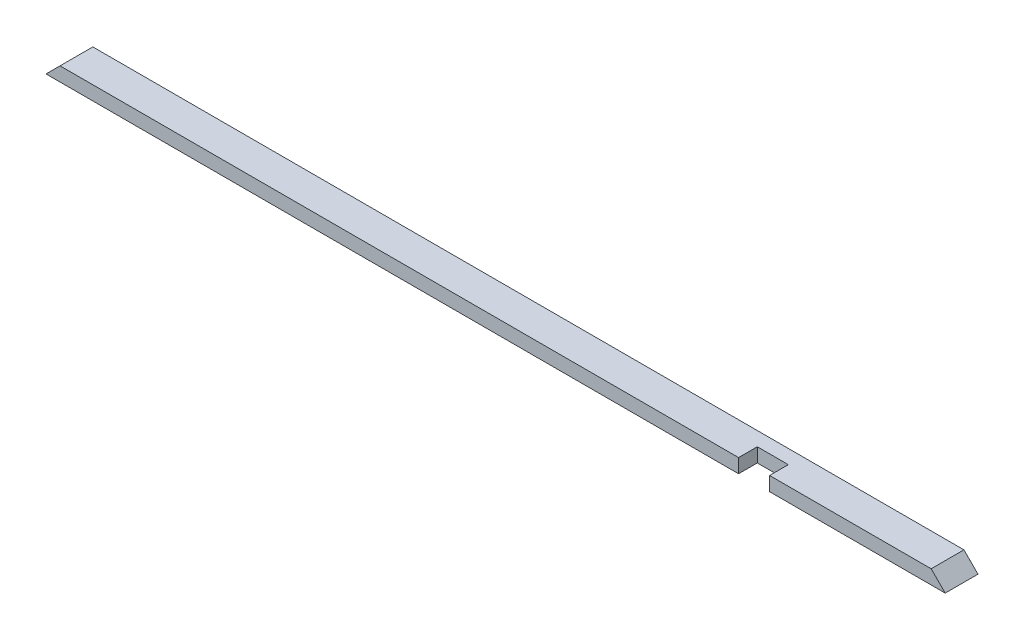
ISO-10303-21;
HEADER;
FILE_DESCRIPTION(('STEP AP214'),'2;1');
FILE_NAME('part.step','',(''),(''),'','','');
FILE_SCHEMA(('AUTOMOTIVE_DESIGN { 1 0 10303 214 1 1 1 1 }'));
ENDSEC;
DATA;
#1=APPLICATION_CONTEXT('core data for automotive mechanical design processes');
#2=APPLICATION_PROTOCOL_DEFINITION('international standard','automotive_design',2000,#1);
#3=PRODUCT_CONTEXT('',#1,'mechanical');
#4=PRODUCT('Part','Part','',(#3));
#5=PRODUCT_RELATED_PRODUCT_CATEGORY('part','',(#4));
#6=PRODUCT_DEFINITION_FORMATION('','',#4);
#7=PRODUCT_DEFINITION_CONTEXT('part definition',#1,'design');
#8=PRODUCT_DEFINITION('design','',#6,#7);
#9=PRODUCT_DEFINITION_SHAPE('','',#8);
#10=(LENGTH_UNIT() NAMED_UNIT(*) SI_UNIT(.MILLI.,.METRE.));
#11=(NAMED_UNIT(*) PLANE_ANGLE_UNIT() SI_UNIT($,.RADIAN.));
#12=(NAMED_UNIT(*) SI_UNIT($,.STERADIAN.) SOLID_ANGLE_UNIT());
#13=UNCERTAINTY_MEASURE_WITH_UNIT(LENGTH_MEASURE(1.E-05),#10,'distance_accuracy_value','');
#14=(GEOMETRIC_REPRESENTATION_CONTEXT(3) GLOBAL_UNCERTAINTY_ASSIGNED_CONTEXT((#13)) GLOBAL_UNIT_ASSIGNED_CONTEXT((#10,
#11,#12)) REPRESENTATION_CONTEXT('',''));
#15=CARTESIAN_POINT('',(0.,0.,0.));
#16=DIRECTION('',(0.,0.,1.));
#17=DIRECTION('',(1.,0.,0.));
#18=AXIS2_PLACEMENT_3D('',#15,#16,#17);
#19=CARTESIAN_POINT('',(0.,38.1,0.));
#20=DIRECTION('',(0.,0.,-1.));
#21=DIRECTION('',(-1.,0.,0.));
#22=AXIS2_PLACEMENT_3D('',#19,#20,#21);
#23=PLANE('',#22);
#24=DIRECTION('',(1.,0.,0.));
#25=VECTOR('',#24,1.);
#26=CARTESIAN_POINT('',(0.,38.1,0.));
#27=LINE('',#26,#25);
#28=CARTESIAN_POINT('',(1962.15,38.1,0.));
#29=VERTEX_POINT('',#28);
#30=CARTESIAN_POINT('',(2400.3,38.1,0.));
#31=VERTEX_POINT('',#30);
#32=EDGE_CURVE('E158',#29,#31,#27,.T.);
#33=ORIENTED_EDGE('',*,*,#32,.F.);
#34=DIRECTION('',(0.,1.,0.));
#35=VECTOR('',#34,1.);
#36=CARTESIAN_POINT('',(1962.15,0.,0.));
#37=LINE('',#36,#35);
#38=CARTESIAN_POINT('',(1962.15,0.,0.));
#39=VERTEX_POINT('',#38);
#40=EDGE_CURVE('E135',#39,#29,#37,.T.);
#41=ORIENTED_EDGE('',*,*,#40,.F.);
#42=DIRECTION('',(1.,0.,0.));
#43=VECTOR('',#42,1.);
#44=CARTESIAN_POINT('',(0.,0.,0.));
#45=LINE('',#44,#43);
#46=CARTESIAN_POINT('',(2438.4,0.,0.));
#47=VERTEX_POINT('',#46);
#48=EDGE_CURVE('E126',#39,#47,#45,.T.);
#49=ORIENTED_EDGE('',*,*,#48,.T.);
#50=DIRECTION('',(0.707106781186548,-0.707106781186547,0.));
#51=VECTOR('',#50,1.);
#52=CARTESIAN_POINT('',(2400.3,38.1,0.));
#53=LINE('',#52,#51);
#54=EDGE_CURVE('E146',#31,#47,#53,.T.);
#55=ORIENTED_EDGE('',*,*,#54,.F.);
#56=EDGE_LOOP('',(#33,#41,#49,#55));
#57=FACE_BOUND('',#56,.T.);
#58=ADVANCED_FACE('F39',(#57),#23,.F.);
#59=CARTESIAN_POINT('',(0.,0.,0.));
#60=VERTEX_POINT('',#59);
#61=CARTESIAN_POINT('',(1878.0125,0.,0.));
#62=VERTEX_POINT('',#61);
#63=EDGE_CURVE('E161',#60,#62,#45,.T.);
#64=ORIENTED_EDGE('',*,*,#63,.T.);
#65=DIRECTION('',(0.,1.,0.));
#66=VECTOR('',#65,1.);
#67=CARTESIAN_POINT('',(1878.0125,0.,0.));
#68=LINE('',#67,#66);
#69=CARTESIAN_POINT('',(1878.0125,38.1,0.));
#70=VERTEX_POINT('',#69);
#71=EDGE_CURVE('E138',#62,#70,#68,.T.);
#72=ORIENTED_EDGE('',*,*,#71,.T.);
#73=CARTESIAN_POINT('',(38.1,38.1,0.));
#74=VERTEX_POINT('',#73);
#75=EDGE_CURVE('E48',#74,#70,#27,.T.);
#76=ORIENTED_EDGE('',*,*,#75,.F.);
#77=DIRECTION('',(0.707106781186547,0.707106781186547,0.));
#78=VECTOR('',#77,1.);
#79=CARTESIAN_POINT('',(0.,0.,0.));
#80=LINE('',#79,#78);
#81=EDGE_CURVE('E144',#60,#74,#80,.T.);
#82=ORIENTED_EDGE('',*,*,#81,.F.);
#83=EDGE_LOOP('',(#64,#72,#76,#82));
#84=FACE_BOUND('',#83,.T.);
#85=ADVANCED_FACE('F41',(#84),#23,.F.);
#86=CARTESIAN_POINT('',(0.,38.1,-88.9));
#87=DIRECTION('',(0.,0.,1.));
#88=DIRECTION('',(1.,0.,0.));
#89=AXIS2_PLACEMENT_3D('',#86,#87,#88);
#90=PLANE('',#89);
#91=DIRECTION('',(-1.,0.,0.));
#92=VECTOR('',#91,1.);
#93=CARTESIAN_POINT('',(0.,0.,-88.9));
#94=LINE('',#93,#92);
#95=CARTESIAN_POINT('',(2438.4,0.,-88.9));
#96=VERTEX_POINT('',#95);
#97=CARTESIAN_POINT('',(0.,0.,-88.9));
#98=VERTEX_POINT('',#97);
#99=EDGE_CURVE('E43',#96,#98,#94,.T.);
#100=ORIENTED_EDGE('',*,*,#99,.T.);
#101=DIRECTION('',(0.707106781186547,0.707106781186547,0.));
#102=VECTOR('',#101,1.);
#103=CARTESIAN_POINT('',(0.,0.,-88.9));
#104=LINE('',#103,#102);
#105=CARTESIAN_POINT('',(38.1,38.1,-88.9));
#106=VERTEX_POINT('',#105);
#107=EDGE_CURVE('E64',#98,#106,#104,.T.);
#108=ORIENTED_EDGE('',*,*,#107,.T.);
#109=DIRECTION('',(-1.,0.,0.));
#110=VECTOR('',#109,1.);
#111=CARTESIAN_POINT('',(0.,38.1,-88.9));
#112=LINE('',#111,#110);
#113=CARTESIAN_POINT('',(2400.3,38.1,-88.9));
#114=VERTEX_POINT('',#113);
#115=EDGE_CURVE('E11',#114,#106,#112,.T.);
#116=ORIENTED_EDGE('',*,*,#115,.F.);
#117=DIRECTION('',(0.707106781186548,-0.707106781186547,0.));
#118=VECTOR('',#117,1.);
#119=CARTESIAN_POINT('',(2400.3,38.1,-88.9));
#120=LINE('',#119,#118);
#121=EDGE_CURVE('E152',#114,#96,#120,.T.);
#122=ORIENTED_EDGE('',*,*,#121,.T.);
#123=EDGE_LOOP('',(#100,#108,#116,#122));
#124=FACE_BOUND('',#123,.T.);
#125=ADVANCED_FACE('F181',(#124),#90,.F.);
#126=CARTESIAN_POINT('',(0.,38.1,0.));
#127=DIRECTION('',(0.,-1.,0.));
#128=DIRECTION('',(0.,0.,-1.));
#129=AXIS2_PLACEMENT_3D('',#126,#127,#128);
#130=PLANE('',#129);
#131=DIRECTION('',(-1.,0.,0.));
#132=VECTOR('',#131,1.);
#133=CARTESIAN_POINT('',(1962.15,38.1,-50.8));
#134=LINE('',#133,#132);
#135=CARTESIAN_POINT('',(1962.15,38.1,-50.8));
#136=VERTEX_POINT('',#135);
#137=CARTESIAN_POINT('',(1878.0125,38.1,-50.8));
#138=VERTEX_POINT('',#137);
#139=EDGE_CURVE('E129',#136,#138,#134,.T.);
#140=ORIENTED_EDGE('',*,*,#139,.F.);
#141=DIRECTION('',(0.,0.,-1.));
#142=VECTOR('',#141,1.);
#143=CARTESIAN_POINT('',(1962.15,38.1,0.));
#144=LINE('',#143,#142);
#145=EDGE_CURVE('E112',#29,#136,#144,.T.);
#146=ORIENTED_EDGE('',*,*,#145,.F.);
#147=ORIENTED_EDGE('',*,*,#32,.T.);
#148=DIRECTION('',(0.,0.,1.));
#149=VECTOR('',#148,1.);
#150=CARTESIAN_POINT('',(2400.3,38.1,-88.9));
#151=LINE('',#150,#149);
#152=EDGE_CURVE('E137',#114,#31,#151,.T.);
#153=ORIENTED_EDGE('',*,*,#152,.F.);
#154=ORIENTED_EDGE('',*,*,#115,.T.);
#155=DIRECTION('',(0.,0.,1.));
#156=VECTOR('',#155,1.);
#157=CARTESIAN_POINT('',(38.1,38.1,-88.9));
#158=LINE('',#157,#156);
#159=EDGE_CURVE('E143',#106,#74,#158,.T.);
#160=ORIENTED_EDGE('',*,*,#159,.T.);
#161=ORIENTED_EDGE('',*,*,#75,.T.);
#162=DIRECTION('',(0.,0.,1.));
#163=VECTOR('',#162,1.);
#164=CARTESIAN_POINT('',(1878.0125,38.1,0.));
#165=LINE('',#164,#163);
#166=EDGE_CURVE('E127',#138,#70,#165,.T.);
#167=ORIENTED_EDGE('',*,*,#166,.F.);
#168=EDGE_LOOP('',(#140,#146,#147,#153,#154,#160,#161,#167));
#169=FACE_BOUND('',#168,.T.);
#170=ADVANCED_FACE('F171',(#169),#130,.F.);
#171=CARTESIAN_POINT('',(0.,0.,0.));
#172=DIRECTION('',(0.,-1.,0.));
#173=DIRECTION('',(0.,0.,-1.));
#174=AXIS2_PLACEMENT_3D('',#171,#172,#173);
#175=PLANE('',#174);
#176=DIRECTION('',(0.,0.,-1.));
#177=VECTOR('',#176,1.);
#178=CARTESIAN_POINT('',(1962.15,0.,0.));
#179=LINE('',#178,#177);
#180=CARTESIAN_POINT('',(1962.15,0.,-50.8));
#181=VERTEX_POINT('',#180);
#182=EDGE_CURVE('E109',#39,#181,#179,.T.);
#183=ORIENTED_EDGE('',*,*,#182,.T.);
#184=DIRECTION('',(-1.,0.,0.));
#185=VECTOR('',#184,1.);
#186=CARTESIAN_POINT('',(1962.15,0.,-50.8));
#187=LINE('',#186,#185);
#188=CARTESIAN_POINT('',(1878.0125,0.,-50.8));
#189=VERTEX_POINT('',#188);
#190=EDGE_CURVE('E119',#181,#189,#187,.T.);
#191=ORIENTED_EDGE('',*,*,#190,.T.);
#192=DIRECTION('',(0.,0.,1.));
#193=VECTOR('',#192,1.);
#194=CARTESIAN_POINT('',(1878.0125,0.,0.));
#195=LINE('',#194,#193);
#196=EDGE_CURVE('E56',#189,#62,#195,.T.);
#197=ORIENTED_EDGE('',*,*,#196,.T.);
#198=ORIENTED_EDGE('',*,*,#63,.F.);
#199=DIRECTION('',(0.,0.,1.));
#200=VECTOR('',#199,1.);
#201=CARTESIAN_POINT('',(0.,0.,0.));
#202=LINE('',#201,#200);
#203=EDGE_CURVE('E149',#98,#60,#202,.T.);
#204=ORIENTED_EDGE('',*,*,#203,.F.);
#205=ORIENTED_EDGE('',*,*,#99,.F.);
#206=DIRECTION('',(0.,0.,-1.));
#207=VECTOR('',#206,1.);
#208=CARTESIAN_POINT('',(2438.4,0.,0.));
#209=LINE('',#208,#207);
#210=EDGE_CURVE('E163',#47,#96,#209,.T.);
#211=ORIENTED_EDGE('',*,*,#210,.F.);
#212=ORIENTED_EDGE('',*,*,#48,.F.);
#213=EDGE_LOOP('',(#183,#191,#197,#198,#204,#205,#211,#212));
#214=FACE_BOUND('',#213,.T.);
#215=ADVANCED_FACE('F124',(#214),#175,.T.);
#216=CARTESIAN_POINT('',(2400.3,38.1,-88.9));
#217=DIRECTION('',(-0.707106781186547,-0.707106781186548,0.));
#218=DIRECTION('',(0.707106781186548,-0.707106781186547,0.));
#219=AXIS2_PLACEMENT_3D('',#216,#217,#218);
#220=PLANE('',#219);
#221=ORIENTED_EDGE('',*,*,#54,.T.);
#222=ORIENTED_EDGE('',*,*,#210,.T.);
#223=ORIENTED_EDGE('',*,*,#121,.F.);
#224=ORIENTED_EDGE('',*,*,#152,.T.);
#225=EDGE_LOOP('',(#221,#222,#223,#224));
#226=FACE_BOUND('',#225,.T.);
#227=ADVANCED_FACE('F175',(#226),#220,.F.);
#228=CARTESIAN_POINT('',(0.,0.,-88.9));
#229=DIRECTION('',(0.707106781186547,-0.707106781186547,0.));
#230=DIRECTION('',(0.707106781186548,0.707106781186548,0.));
#231=AXIS2_PLACEMENT_3D('',#228,#229,#230);
#232=PLANE('',#231);
#233=ORIENTED_EDGE('',*,*,#81,.T.);
#234=ORIENTED_EDGE('',*,*,#159,.F.);
#235=ORIENTED_EDGE('',*,*,#107,.F.);
#236=ORIENTED_EDGE('',*,*,#203,.T.);
#237=EDGE_LOOP('',(#233,#234,#235,#236));
#238=FACE_BOUND('',#237,.T.);
#239=ADVANCED_FACE('F190',(#238),#232,.F.);
#240=CARTESIAN_POINT('',(1962.15,0.,0.));
#241=DIRECTION('',(1.,0.,0.));
#242=DIRECTION('',(0.,0.,-1.));
#243=AXIS2_PLACEMENT_3D('',#240,#241,#242);
#244=PLANE('',#243);
#245=ORIENTED_EDGE('',*,*,#145,.T.);
#246=DIRECTION('',(0.,1.,0.));
#247=VECTOR('',#246,1.);
#248=CARTESIAN_POINT('',(1962.15,0.,-50.8));
#249=LINE('',#248,#247);
#250=EDGE_CURVE('E105',#181,#136,#249,.T.);
#251=ORIENTED_EDGE('',*,*,#250,.F.);
#252=ORIENTED_EDGE('',*,*,#182,.F.);
#253=ORIENTED_EDGE('',*,*,#40,.T.);
#254=EDGE_LOOP('',(#245,#251,#252,#253));
#255=FACE_BOUND('',#254,.T.);
#256=ADVANCED_FACE('F107',(#255),#244,.F.);
#257=CARTESIAN_POINT('',(1878.0125,0.,0.));
#258=DIRECTION('',(-1.,0.,0.));
#259=DIRECTION('',(0.,0.,1.));
#260=AXIS2_PLACEMENT_3D('',#257,#258,#259);
#261=PLANE('',#260);
#262=ORIENTED_EDGE('',*,*,#166,.T.);
#263=ORIENTED_EDGE('',*,*,#71,.F.);
#264=ORIENTED_EDGE('',*,*,#196,.F.);
#265=DIRECTION('',(0.,1.,0.));
#266=VECTOR('',#265,1.);
#267=CARTESIAN_POINT('',(1878.0125,0.,-50.8));
#268=LINE('',#267,#266);
#269=EDGE_CURVE('E116',#189,#138,#268,.T.);
#270=ORIENTED_EDGE('',*,*,#269,.T.);
#271=EDGE_LOOP('',(#262,#263,#264,#270));
#272=FACE_BOUND('',#271,.T.);
#273=ADVANCED_FACE('F192',(#272),#261,.F.);
#274=CARTESIAN_POINT('',(1962.15,0.,-50.8));
#275=DIRECTION('',(0.,0.,-1.));
#276=DIRECTION('',(-1.,0.,0.));
#277=AXIS2_PLACEMENT_3D('',#274,#275,#276);
#278=PLANE('',#277);
#279=ORIENTED_EDGE('',*,*,#139,.T.);
#280=ORIENTED_EDGE('',*,*,#269,.F.);
#281=ORIENTED_EDGE('',*,*,#190,.F.);
#282=ORIENTED_EDGE('',*,*,#250,.T.);
#283=EDGE_LOOP('',(#279,#280,#281,#282));
#284=FACE_BOUND('',#283,.T.);
#285=ADVANCED_FACE('F120',(#284),#278,.F.);
#286=CLOSED_SHELL('',(#58,#85,#125,#170,#215,#227,#239,#256,#273,#285));
#287=MANIFOLD_SOLID_BREP('B2',#286);
#288=ADVANCED_BREP_SHAPE_REPRESENTATION('',(#18,#287),#14);
#289=SHAPE_DEFINITION_REPRESENTATION(#9,#288);
ENDSEC;
END-ISO-10303-21;
